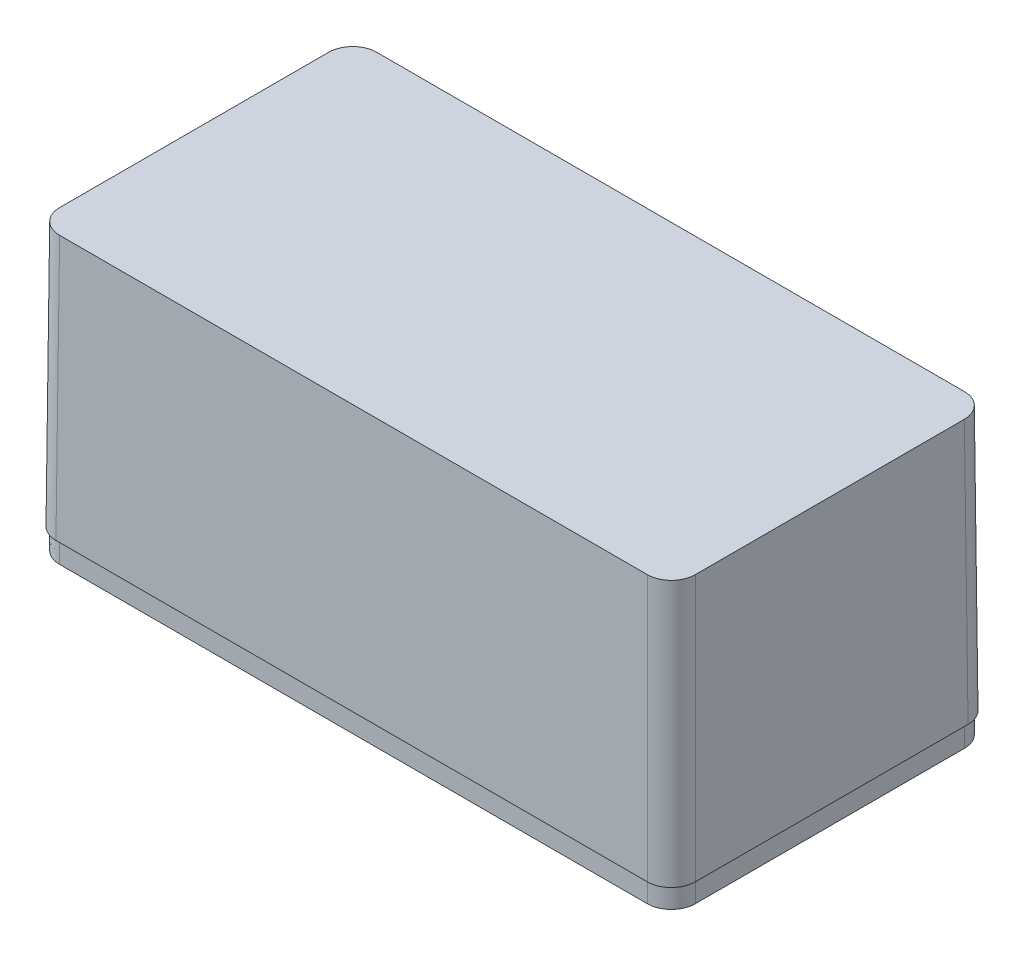
ISO-10303-21;
HEADER;
FILE_DESCRIPTION(('STEP AP214'),'2;1');
FILE_NAME('part.step','',(''),(''),'','','');
FILE_SCHEMA(('AUTOMOTIVE_DESIGN { 1 0 10303 214 1 1 1 1 }'));
ENDSEC;
DATA;
#1=APPLICATION_CONTEXT('core data for automotive mechanical design processes');
#2=APPLICATION_PROTOCOL_DEFINITION('international standard','automotive_design',2000,#1);
#3=PRODUCT_CONTEXT('',#1,'mechanical');
#4=PRODUCT('Part','Part','',(#3));
#5=PRODUCT_RELATED_PRODUCT_CATEGORY('part','',(#4));
#6=PRODUCT_DEFINITION_FORMATION('','',#4);
#7=PRODUCT_DEFINITION_CONTEXT('part definition',#1,'design');
#8=PRODUCT_DEFINITION('design','',#6,#7);
#9=PRODUCT_DEFINITION_SHAPE('','',#8);
#10=(LENGTH_UNIT() NAMED_UNIT(*) SI_UNIT(.MILLI.,.METRE.));
#11=(NAMED_UNIT(*) PLANE_ANGLE_UNIT() SI_UNIT($,.RADIAN.));
#12=(NAMED_UNIT(*) SI_UNIT($,.STERADIAN.) SOLID_ANGLE_UNIT());
#13=UNCERTAINTY_MEASURE_WITH_UNIT(LENGTH_MEASURE(1.E-05),#10,'distance_accuracy_value','');
#14=(GEOMETRIC_REPRESENTATION_CONTEXT(3) GLOBAL_UNCERTAINTY_ASSIGNED_CONTEXT((#13)) GLOBAL_UNIT_ASSIGNED_CONTEXT((#10,
#11,#12)) REPRESENTATION_CONTEXT('',''));
#15=CARTESIAN_POINT('',(0.,0.,0.));
#16=DIRECTION('',(0.,0.,1.));
#17=DIRECTION('',(1.,0.,0.));
#18=AXIS2_PLACEMENT_3D('',#15,#16,#17);
#19=CARTESIAN_POINT('',(0.,-10.2,0.));
#20=DIRECTION('',(0.,-1.,0.));
#21=DIRECTION('',(0.,0.,-1.));
#22=AXIS2_PLACEMENT_3D('',#19,#20,#21);
#23=PLANE('',#22);
#24=CARTESIAN_POINT('',(-19.4106716571701,-10.2,9.46067287566872));
#25=CARTESIAN_POINT('',(-18.9713469698294,-10.2,9.89999756300882));
#26=CARTESIAN_POINT('',(-18.3500328984596,-10.2,9.89999756301078));
#27=(BOUNDED_CURVE() B_SPLINE_CURVE(2,(#24,#25,#26),.UNSPECIFIED.,.F.,
.F.) B_SPLINE_CURVE_WITH_KNOTS((3,3),(3.14159265358979,3.92696771372544),
.UNSPECIFIED.) CURVE() GEOMETRIC_REPRESENTATION_ITEM() RATIONAL_B_SPLINE_CURVE((0.999999999999869,
0.853557698464764,0.853553390720027)) REPRESENTATION_ITEM(''));
#28=CARTESIAN_POINT('',(-18.3500328984598,-10.2,9.89999756301086));
#29=VERTEX_POINT('',#28);
#30=CARTESIAN_POINT('',(-19.4106716571704,-10.2,9.46067287566838));
#31=VERTEX_POINT('',#30);
#32=EDGE_CURVE('E19',#29,#31,#27,.F.);
#33=ORIENTED_EDGE('',*,*,#32,.T.);
#34=CARTESIAN_POINT('',(-19.8499963445129,-10.2,8.40003411695301));
#35=CARTESIAN_POINT('',(-19.8499963445129,-10.2,9.02134818832588));
#36=CARTESIAN_POINT('',(-19.4106716571704,-10.2,9.46067287566838));
#37=(BOUNDED_CURVE() B_SPLINE_CURVE(2,(#34,#35,#36),.UNSPECIFIED.,.F.,
.F.) B_SPLINE_CURVE_WITH_KNOTS((3,3),(2.35621759345099,3.14159265358979),
.UNSPECIFIED.) CURVE() GEOMETRIC_REPRESENTATION_ITEM() RATIONAL_B_SPLINE_CURVE((0.853553390719994,
0.853557698464176,0.999999999999998)) REPRESENTATION_ITEM(''));
#38=CARTESIAN_POINT('',(-19.8499963445147,-10.2,8.400034116953));
#39=VERTEX_POINT('',#38);
#40=EDGE_CURVE('E148',#31,#39,#37,.F.);
#41=ORIENTED_EDGE('',*,*,#40,.T.);
#42=DIRECTION('',(0.,0.,1.));
#43=VECTOR('',#42,1.);
#44=CARTESIAN_POINT('',(-19.84999634452,-10.2,-8.400034116953));
#45=LINE('',#44,#43);
#46=CARTESIAN_POINT('',(-19.8499963445164,-10.2,-8.400034116953));
#47=VERTEX_POINT('',#46);
#48=EDGE_CURVE('E165',#47,#39,#45,.T.);
#49=ORIENTED_EDGE('',*,*,#48,.F.);
#50=CARTESIAN_POINT('',(-19.4106716571704,-10.2,-9.46067287566838));
#51=CARTESIAN_POINT('',(-19.8499963445129,-10.2,-9.02134818832588));
#52=CARTESIAN_POINT('',(-19.8499963445129,-10.2,-8.400034116953));
#53=(BOUNDED_CURVE() B_SPLINE_CURVE(2,(#50,#51,#52),.UNSPECIFIED.,.F.,
.F.) B_SPLINE_CURVE_WITH_KNOTS((3,3),(3.14159265358979,3.92696771372859),
.UNSPECIFIED.) CURVE() GEOMETRIC_REPRESENTATION_ITEM() RATIONAL_B_SPLINE_CURVE((0.999999999999998,
0.853557698464176,0.853553390719995)) REPRESENTATION_ITEM(''));
#54=CARTESIAN_POINT('',(-19.4106716571704,-10.2,-9.46067287566838));
#55=VERTEX_POINT('',#54);
#56=EDGE_CURVE('E176',#55,#47,#53,.T.);
#57=ORIENTED_EDGE('',*,*,#56,.F.);
#58=CARTESIAN_POINT('',(-18.35003289846,-10.2,-9.8999975630109));
#59=CARTESIAN_POINT('',(-18.9713469698294,-10.2,-9.89999756300882));
#60=CARTESIAN_POINT('',(-19.41067165717,-10.2,-9.46067287566873));
#61=(BOUNDED_CURVE() B_SPLINE_CURVE(2,(#58,#59,#60),.UNSPECIFIED.,.F.,
.F.) B_SPLINE_CURVE_WITH_KNOTS((3,3),(2.35621759345414,3.14159265358979),
.UNSPECIFIED.) CURVE() GEOMETRIC_REPRESENTATION_ITEM() RATIONAL_B_SPLINE_CURVE((0.853553390719994,
0.853557698464764,0.999999999999869)) REPRESENTATION_ITEM(''));
#62=CARTESIAN_POINT('',(-18.35003289846,-10.2,-9.89999756301095));
#63=VERTEX_POINT('',#62);
#64=EDGE_CURVE('E359',#63,#55,#61,.T.);
#65=ORIENTED_EDGE('',*,*,#64,.F.);
#66=DIRECTION('',(-1.,0.,0.));
#67=VECTOR('',#66,1.);
#68=CARTESIAN_POINT('',(18.35003289846,-10.2,-9.899997563011));
#69=LINE('',#68,#67);
#70=CARTESIAN_POINT('',(18.35003289846,-10.2,-9.89999756301095));
#71=VERTEX_POINT('',#70);
#72=EDGE_CURVE('E404',#71,#63,#69,.T.);
#73=ORIENTED_EDGE('',*,*,#72,.F.);
#74=CARTESIAN_POINT('',(19.4106716571704,-10.2,-9.46067287566838));
#75=CARTESIAN_POINT('',(18.97134696983,-10.2,-9.89999756300881));
#76=CARTESIAN_POINT('',(18.35003289846,-10.2,-9.8999975630109));
#77=(BOUNDED_CURVE() B_SPLINE_CURVE(2,(#74,#75,#76),.UNSPECIFIED.,.F.,
.F.) B_SPLINE_CURVE_WITH_KNOTS((3,3),(3.14159265358979,3.92696771372543),
.UNSPECIFIED.) CURVE() GEOMETRIC_REPRESENTATION_ITEM() RATIONAL_B_SPLINE_CURVE((1.,
0.853557698464766,0.853553390719993)) REPRESENTATION_ITEM(''));
#78=CARTESIAN_POINT('',(19.4106716571704,-10.2,-9.46067287566838));
#79=VERTEX_POINT('',#78);
#80=EDGE_CURVE('E367',#79,#71,#77,.T.);
#81=ORIENTED_EDGE('',*,*,#80,.F.);
#82=CARTESIAN_POINT('',(19.8499963445129,-10.2,-8.400034116953));
#83=CARTESIAN_POINT('',(19.8499963445129,-10.2,-9.02134818832533));
#84=CARTESIAN_POINT('',(19.4106716571707,-10.2,-9.46067287566805));
#85=(BOUNDED_CURVE() B_SPLINE_CURVE(2,(#82,#83,#84),.UNSPECIFIED.,.F.,
.F.) B_SPLINE_CURVE_WITH_KNOTS((3,3),(2.35621759345098,3.14159265358979),
.UNSPECIFIED.) CURVE() GEOMETRIC_REPRESENTATION_ITEM() RATIONAL_B_SPLINE_CURVE((0.853553390719994,
0.853557698464175,0.999999999999868)) REPRESENTATION_ITEM(''));
#86=CARTESIAN_POINT('',(19.8499963445165,-10.2,-8.400034116953));
#87=VERTEX_POINT('',#86);
#88=EDGE_CURVE('E216',#87,#79,#85,.T.);
#89=ORIENTED_EDGE('',*,*,#88,.F.);
#90=DIRECTION('',(0.,0.,-1.));
#91=VECTOR('',#90,1.);
#92=CARTESIAN_POINT('',(19.84999634452,-10.2,8.400034116953));
#93=LINE('',#92,#91);
#94=CARTESIAN_POINT('',(19.8499963445164,-10.2,8.400034116953));
#95=VERTEX_POINT('',#94);
#96=EDGE_CURVE('E217',#95,#87,#93,.T.);
#97=ORIENTED_EDGE('',*,*,#96,.F.);
#98=CARTESIAN_POINT('',(19.4106716571704,-10.2,9.46067287566838));
#99=CARTESIAN_POINT('',(19.8499963445129,-10.2,9.02134818832588));
#100=CARTESIAN_POINT('',(19.8499963445129,-10.2,8.400034116953));
#101=(BOUNDED_CURVE() B_SPLINE_CURVE(2,(#98,#99,#100),.UNSPECIFIED.,.F.,
.F.) B_SPLINE_CURVE_WITH_KNOTS((3,3),(3.14159265358979,3.92696771372859),
.UNSPECIFIED.) CURVE() GEOMETRIC_REPRESENTATION_ITEM() RATIONAL_B_SPLINE_CURVE((0.999999999999998,
0.853557698464176,0.853553390719995)) REPRESENTATION_ITEM(''));
#102=CARTESIAN_POINT('',(19.4106716571704,-10.2,9.46067287566838));
#103=VERTEX_POINT('',#102);
#104=EDGE_CURVE('E221',#103,#95,#101,.T.);
#105=ORIENTED_EDGE('',*,*,#104,.F.);
#106=CARTESIAN_POINT('',(18.35003289846,-10.2,9.8999975630109));
#107=CARTESIAN_POINT('',(18.9713469698294,-10.2,9.89999756300882));
#108=CARTESIAN_POINT('',(19.41067165717,-10.2,9.46067287566873));
#109=(BOUNDED_CURVE() B_SPLINE_CURVE(2,(#106,#107,#108),.UNSPECIFIED.,.F.,
.F.) B_SPLINE_CURVE_WITH_KNOTS((3,3),(2.35621759345414,3.14159265358979),
.UNSPECIFIED.) CURVE() GEOMETRIC_REPRESENTATION_ITEM() RATIONAL_B_SPLINE_CURVE((0.853553390719994,
0.853557698464764,0.999999999999869)) REPRESENTATION_ITEM(''));
#110=CARTESIAN_POINT('',(18.35003289846,-10.2,9.89999756301095));
#111=VERTEX_POINT('',#110);
#112=EDGE_CURVE('E153',#111,#103,#109,.T.);
#113=ORIENTED_EDGE('',*,*,#112,.F.);
#114=DIRECTION('',(1.,0.,0.));
#115=VECTOR('',#114,1.);
#116=CARTESIAN_POINT('',(-18.35003289846,-10.2,9.899997563011));
#117=LINE('',#116,#115);
#118=EDGE_CURVE('E151',#29,#111,#117,.T.);
#119=ORIENTED_EDGE('',*,*,#118,.F.);
#120=EDGE_LOOP('',(#33,#41,#49,#57,#65,#73,#81,#89,#97,#105,#113,#119));
#121=FACE_BOUND('',#120,.T.);
#122=ADVANCED_FACE('F16',(#121),#23,.T.);
#123=CARTESIAN_POINT('',(-18.35003289846,7.6,9.899997563011));
#124=DIRECTION('',(0.,0.,1.));
#125=DIRECTION('',(1.,0.,0.));
#126=AXIS2_PLACEMENT_3D('',#123,#124,#125);
#127=PLANE('',#126);
#128=DIRECTION('',(0.,1.,0.));
#129=VECTOR('',#128,1.);
#130=CARTESIAN_POINT('',(18.35003289846,7.6,9.8999975630109));
#131=LINE('',#130,#129);
#132=CARTESIAN_POINT('',(18.35003289846,-8.9,9.89999756301092));
#133=VERTEX_POINT('',#132);
#134=EDGE_CURVE('E156',#133,#111,#131,.F.);
#135=ORIENTED_EDGE('',*,*,#134,.F.);
#136=DIRECTION('',(1.,0.,0.));
#137=VECTOR('',#136,1.);
#138=CARTESIAN_POINT('',(-26.71628930331,-8.9,9.899997563011));
#139=LINE('',#138,#137);
#140=CARTESIAN_POINT('',(-18.35003289846,-8.9,9.89999756301095));
#141=VERTEX_POINT('',#140);
#142=EDGE_CURVE('E160',#141,#133,#139,.T.);
#143=ORIENTED_EDGE('',*,*,#142,.F.);
#144=DIRECTION('',(0.,1.,0.));
#145=VECTOR('',#144,1.);
#146=CARTESIAN_POINT('',(-18.35003289846,7.6,9.8999975630109));
#147=LINE('',#146,#145);
#148=EDGE_CURVE('E145',#29,#141,#147,.T.);
#149=ORIENTED_EDGE('',*,*,#148,.F.);
#150=ORIENTED_EDGE('',*,*,#118,.T.);
#151=EDGE_LOOP('',(#135,#143,#149,#150));
#152=FACE_BOUND('',#151,.T.);
#153=ADVANCED_FACE('F158',(#152),#127,.T.);
#154=CARTESIAN_POINT('',(17.2892479221896,7.6,7.33924914068761));
#155=CARTESIAN_POINT('',(16.2285877504098,7.6,8.39990931246743));
#156=CARTESIAN_POINT('',(17.2892996179002,7.6,9.46062117995782));
#157=CARTESIAN_POINT('',(18.3500114853906,7.6,10.5213330474482));
#158=CARTESIAN_POINT('',(19.4106716571704,7.6,9.46067287566839));
#159=CARTESIAN_POINT('',(20.4713318289502,7.6,8.40001270388857));
#160=CARTESIAN_POINT('',(19.4106199614598,7.6,7.33930083639818));
#161=CARTESIAN_POINT('',(18.3499080939694,7.6,6.27858896890779));
#162=CARTESIAN_POINT('',(17.2892479221896,7.6,7.33924914068761));
#163=(BOUNDED_CURVE() B_SPLINE_CURVE(2,(#154,#155,#156,#157,#158,#159,#160,#161,#162),
.UNSPECIFIED.,.T.,.F.) B_SPLINE_CURVE_WITH_KNOTS((3,2,2,2,3),(0.,1.5707963267949,
3.14159265358979,4.71238898038469,6.28318530717959),
.UNSPECIFIED.) CURVE() GEOMETRIC_REPRESENTATION_ITEM() RATIONAL_B_SPLINE_CURVE((1.,
0.707106781186548,1.,0.707106781186548,1.,0.707106781186548,1.,0.707106781186548,1.)) REPRESENTATION_ITEM(''));
#164=DIRECTION('',(0.,1.,0.));
#165=VECTOR('',#164,1.);
#166=SURFACE_OF_LINEAR_EXTRUSION('',#163,#165);
#167=DIRECTION('',(0.,1.,0.));
#168=VECTOR('',#167,1.);
#169=CARTESIAN_POINT('',(19.84999634452,7.6,8.400034116953));
#170=LINE('',#169,#168);
#171=CARTESIAN_POINT('',(19.84999634452,-8.9,8.400034116953));
#172=VERTEX_POINT('',#171);
#173=EDGE_CURVE('E218',#172,#95,#170,.F.);
#174=ORIENTED_EDGE('',*,*,#173,.F.);
#175=CARTESIAN_POINT('',(18.35003289846,-8.9,9.8999975630109));
#176=CARTESIAN_POINT('',(18.97134696983,-8.9,9.89999756300882));
#177=CARTESIAN_POINT('',(19.4106716571704,-8.9,9.46067287566839));
#178=CARTESIAN_POINT('',(19.8499963445128,-8.9,9.02134818832602));
#179=CARTESIAN_POINT('',(19.8499963445129,-8.9,8.40003411695333));
#180=(BOUNDED_CURVE() B_SPLINE_CURVE(2,(#175,#176,#177,#178,#179),.UNSPECIFIED.,.F.,
.F.) B_SPLINE_CURVE_WITH_KNOTS((3,2,3),(2.35621759345414,3.14159265358979,3.9269677137284),
.UNSPECIFIED.) CURVE() GEOMETRIC_REPRESENTATION_ITEM() RATIONAL_B_SPLINE_CURVE((0.853553390719994,
0.853557698464764,1.,0.853557698464213,0.853553390719994)) REPRESENTATION_ITEM(''));
#181=EDGE_CURVE('E163',#133,#172,#180,.T.);
#182=ORIENTED_EDGE('',*,*,#181,.F.);
#183=ORIENTED_EDGE('',*,*,#134,.T.);
#184=ORIENTED_EDGE('',*,*,#112,.T.);
#185=ORIENTED_EDGE('',*,*,#104,.T.);
#186=EDGE_LOOP('',(#174,#182,#183,#184,#185));
#187=FACE_BOUND('',#186,.T.);
#188=ADVANCED_FACE('F229',(#187),#166,.T.);
#189=CARTESIAN_POINT('',(19.84999634452,7.6,8.400034116953));
#190=DIRECTION('',(1.,0.,0.));
#191=DIRECTION('',(0.,0.,-1.));
#192=AXIS2_PLACEMENT_3D('',#189,#190,#191);
#193=PLANE('',#192);
#194=DIRECTION('',(0.,1.,0.));
#195=VECTOR('',#194,1.);
#196=CARTESIAN_POINT('',(19.8499963445129,7.6,-8.400034116953));
#197=LINE('',#196,#195);
#198=CARTESIAN_POINT('',(19.8499963445147,-8.9,-8.400034116953));
#199=VERTEX_POINT('',#198);
#200=EDGE_CURVE('E210',#199,#87,#197,.F.);
#201=ORIENTED_EDGE('',*,*,#200,.F.);
#202=DIRECTION('',(0.,0.,-1.));
#203=VECTOR('',#202,1.);
#204=CARTESIAN_POINT('',(19.84999634452,-8.9,-16.5));
#205=LINE('',#204,#203);
#206=EDGE_CURVE('E307',#172,#199,#205,.T.);
#207=ORIENTED_EDGE('',*,*,#206,.F.);
#208=ORIENTED_EDGE('',*,*,#173,.T.);
#209=ORIENTED_EDGE('',*,*,#96,.T.);
#210=EDGE_LOOP('',(#201,#207,#208,#209));
#211=FACE_BOUND('',#210,.T.);
#212=ADVANCED_FACE('F202',(#211),#193,.T.);
#213=CARTESIAN_POINT('',(17.2892479221896,7.6,-7.33924914068761));
#214=CARTESIAN_POINT('',(18.3499080939694,7.6,-6.27858896890779));
#215=CARTESIAN_POINT('',(19.4106199614598,7.6,-7.33930083639818));
#216=CARTESIAN_POINT('',(20.4713318289502,7.6,-8.40001270388857));
#217=CARTESIAN_POINT('',(19.4106716571704,7.6,-9.46067287566839));
#218=CARTESIAN_POINT('',(18.3500114853906,7.6,-10.5213330474482));
#219=CARTESIAN_POINT('',(17.2892996179002,7.6,-9.46062117995782));
#220=CARTESIAN_POINT('',(16.2285877504098,7.6,-8.39990931246743));
#221=CARTESIAN_POINT('',(17.2892479221896,7.6,-7.33924914068761));
#222=(BOUNDED_CURVE() B_SPLINE_CURVE(2,(#213,#214,#215,#216,#217,#218,#219,#220,#221),
.UNSPECIFIED.,.T.,.F.) B_SPLINE_CURVE_WITH_KNOTS((3,2,2,2,3),(0.,1.5707963267949,
3.14159265358979,4.71238898038469,6.28318530717959),
.UNSPECIFIED.) CURVE() GEOMETRIC_REPRESENTATION_ITEM() RATIONAL_B_SPLINE_CURVE((1.,
0.707106781186548,1.,0.707106781186548,1.,0.707106781186548,1.,0.707106781186548,1.)) REPRESENTATION_ITEM(''));
#223=DIRECTION('',(0.,1.,0.));
#224=VECTOR('',#223,1.);
#225=SURFACE_OF_LINEAR_EXTRUSION('',#222,#224);
#226=DIRECTION('',(0.,1.,0.));
#227=VECTOR('',#226,1.);
#228=CARTESIAN_POINT('',(18.35003289846,7.6,-9.899997563011));
#229=LINE('',#228,#227);
#230=CARTESIAN_POINT('',(18.35003289846,-8.9,-9.899997563011));
#231=VERTEX_POINT('',#230);
#232=EDGE_CURVE('E209',#231,#71,#229,.F.);
#233=ORIENTED_EDGE('',*,*,#232,.F.);
#234=CARTESIAN_POINT('',(19.8499963445129,-8.9,-8.400034116953));
#235=CARTESIAN_POINT('',(19.8499963445129,-8.9,-9.02134818832589));
#236=CARTESIAN_POINT('',(19.4106716571704,-8.9,-9.46067287566839));
#237=CARTESIAN_POINT('',(18.9713469698301,-8.9,-9.89999756300868));
#238=CARTESIAN_POINT('',(18.3500328984603,-8.9,-9.8999975630109));
#239=(BOUNDED_CURVE() B_SPLINE_CURVE(2,(#234,#235,#236,#237,#238),.UNSPECIFIED.,.F.,
.F.) B_SPLINE_CURVE_WITH_KNOTS((3,2,3),(2.35621759345098,3.14159265358979,3.92696771372524),
.UNSPECIFIED.) CURVE() GEOMETRIC_REPRESENTATION_ITEM() RATIONAL_B_SPLINE_CURVE((0.853553390719994,
0.853557698464175,1.,0.853557698464802,0.853553390719994)) REPRESENTATION_ITEM(''));
#240=EDGE_CURVE('E306',#199,#231,#239,.T.);
#241=ORIENTED_EDGE('',*,*,#240,.F.);
#242=ORIENTED_EDGE('',*,*,#200,.T.);
#243=ORIENTED_EDGE('',*,*,#88,.T.);
#244=ORIENTED_EDGE('',*,*,#80,.T.);
#245=EDGE_LOOP('',(#233,#241,#242,#243,#244));
#246=FACE_BOUND('',#245,.T.);
#247=ADVANCED_FACE('F197',(#246),#225,.T.);
#248=CARTESIAN_POINT('',(18.35003289846,7.6,-9.899997563011));
#249=DIRECTION('',(0.,0.,-1.));
#250=DIRECTION('',(-1.,0.,0.));
#251=AXIS2_PLACEMENT_3D('',#248,#249,#250);
#252=PLANE('',#251);
#253=DIRECTION('',(0.,1.,0.));
#254=VECTOR('',#253,1.);
#255=CARTESIAN_POINT('',(-18.35003289846,7.6,-9.8999975630109));
#256=LINE('',#255,#254);
#257=CARTESIAN_POINT('',(-18.35003289846,-8.9,-9.89999756301092));
#258=VERTEX_POINT('',#257);
#259=EDGE_CURVE('E181',#258,#63,#256,.F.);
#260=ORIENTED_EDGE('',*,*,#259,.F.);
#261=DIRECTION('',(1.,0.,0.));
#262=VECTOR('',#261,1.);
#263=CARTESIAN_POINT('',(-26.71628930331,-8.9,-9.899997563011));
#264=LINE('',#263,#262);
#265=EDGE_CURVE('E300',#231,#258,#264,.F.);
#266=ORIENTED_EDGE('',*,*,#265,.F.);
#267=ORIENTED_EDGE('',*,*,#232,.T.);
#268=ORIENTED_EDGE('',*,*,#72,.T.);
#269=EDGE_LOOP('',(#260,#266,#267,#268));
#270=FACE_BOUND('',#269,.T.);
#271=ADVANCED_FACE('F192',(#270),#252,.T.);
#272=CARTESIAN_POINT('',(-17.2892479221896,7.6,-7.33924914068761));
#273=CARTESIAN_POINT('',(-16.2285877504098,7.6,-8.39990931246743));
#274=CARTESIAN_POINT('',(-17.2892996179002,7.6,-9.46062117995782));
#275=CARTESIAN_POINT('',(-18.3500114853906,7.6,-10.5213330474482));
#276=CARTESIAN_POINT('',(-19.4106716571704,7.6,-9.46067287566839));
#277=CARTESIAN_POINT('',(-20.4713318289502,7.6,-8.40001270388857));
#278=CARTESIAN_POINT('',(-19.4106199614598,7.6,-7.33930083639818));
#279=CARTESIAN_POINT('',(-18.3499080939694,7.6,-6.27858896890779));
#280=CARTESIAN_POINT('',(-17.2892479221896,7.6,-7.33924914068761));
#281=(BOUNDED_CURVE() B_SPLINE_CURVE(2,(#272,#273,#274,#275,#276,#277,#278,#279,#280),
.UNSPECIFIED.,.T.,.F.) B_SPLINE_CURVE_WITH_KNOTS((3,2,2,2,3),(0.,1.5707963267949,
3.14159265358979,4.71238898038469,6.28318530717959),
.UNSPECIFIED.) CURVE() GEOMETRIC_REPRESENTATION_ITEM() RATIONAL_B_SPLINE_CURVE((1.,
0.707106781186548,1.,0.707106781186548,1.,0.707106781186548,1.,0.707106781186548,1.)) REPRESENTATION_ITEM(''));
#282=DIRECTION('',(0.,1.,0.));
#283=VECTOR('',#282,1.);
#284=SURFACE_OF_LINEAR_EXTRUSION('',#281,#283);
#285=DIRECTION('',(0.,1.,0.));
#286=VECTOR('',#285,1.);
#287=CARTESIAN_POINT('',(-19.84999634452,7.6,-8.400034116953));
#288=LINE('',#287,#286);
#289=CARTESIAN_POINT('',(-19.84999634452,-8.9,-8.400034116953));
#290=VERTEX_POINT('',#289);
#291=EDGE_CURVE('E173',#290,#47,#288,.F.);
#292=ORIENTED_EDGE('',*,*,#291,.F.);
#293=CARTESIAN_POINT('',(-18.35003289846,-8.9,-9.8999975630109));
#294=CARTESIAN_POINT('',(-18.97134696983,-8.9,-9.89999756300882));
#295=CARTESIAN_POINT('',(-19.4106716571704,-8.9,-9.46067287566839));
#296=CARTESIAN_POINT('',(-19.8499963445128,-8.9,-9.02134818832602));
#297=CARTESIAN_POINT('',(-19.8499963445129,-8.9,-8.40003411695333));
#298=(BOUNDED_CURVE() B_SPLINE_CURVE(2,(#293,#294,#295,#296,#297),.UNSPECIFIED.,.F.,
.F.) B_SPLINE_CURVE_WITH_KNOTS((3,2,3),(2.35621759345414,3.14159265358979,3.92696771372839),
.UNSPECIFIED.) CURVE() GEOMETRIC_REPRESENTATION_ITEM() RATIONAL_B_SPLINE_CURVE((0.853553390719994,
0.853557698464764,1.,0.853557698464214,0.853553390719994)) REPRESENTATION_ITEM(''));
#299=EDGE_CURVE('E298',#258,#290,#298,.T.);
#300=ORIENTED_EDGE('',*,*,#299,.F.);
#301=ORIENTED_EDGE('',*,*,#259,.T.);
#302=ORIENTED_EDGE('',*,*,#64,.T.);
#303=ORIENTED_EDGE('',*,*,#56,.T.);
#304=EDGE_LOOP('',(#292,#300,#301,#302,#303));
#305=FACE_BOUND('',#304,.T.);
#306=ADVANCED_FACE('F187',(#305),#284,.T.);
#307=CARTESIAN_POINT('',(-19.84999634452,7.6,-8.400034116953));
#308=DIRECTION('',(-1.,0.,0.));
#309=DIRECTION('',(0.,0.,1.));
#310=AXIS2_PLACEMENT_3D('',#307,#308,#309);
#311=PLANE('',#310);
#312=DIRECTION('',(0.,1.,0.));
#313=VECTOR('',#312,1.);
#314=CARTESIAN_POINT('',(-19.8499963445129,7.6,8.400034116953));
#315=LINE('',#314,#313);
#316=CARTESIAN_POINT('',(-19.8499963445147,-8.9,8.400034116953));
#317=VERTEX_POINT('',#316);
#318=EDGE_CURVE('E161',#317,#39,#315,.F.);
#319=ORIENTED_EDGE('',*,*,#318,.F.);
#320=DIRECTION('',(0.,0.,-1.));
#321=VECTOR('',#320,1.);
#322=CARTESIAN_POINT('',(-19.84999634452,-8.9,-16.5));
#323=LINE('',#322,#321);
#324=EDGE_CURVE('E289',#290,#317,#323,.F.);
#325=ORIENTED_EDGE('',*,*,#324,.F.);
#326=ORIENTED_EDGE('',*,*,#291,.T.);
#327=ORIENTED_EDGE('',*,*,#48,.T.);
#328=EDGE_LOOP('',(#319,#325,#326,#327));
#329=FACE_BOUND('',#328,.T.);
#330=ADVANCED_FACE('F191',(#329),#311,.T.);
#331=CARTESIAN_POINT('',(-17.2892479221896,7.6,7.33924914068761));
#332=CARTESIAN_POINT('',(-18.3499080939694,7.6,6.27858896890779));
#333=CARTESIAN_POINT('',(-19.4106199614598,7.6,7.33930083639818));
#334=CARTESIAN_POINT('',(-20.4713318289502,7.6,8.40001270388857));
#335=CARTESIAN_POINT('',(-19.4106716571704,7.6,9.46067287566839));
#336=CARTESIAN_POINT('',(-18.3500114853906,7.6,10.5213330474482));
#337=CARTESIAN_POINT('',(-17.2892996179002,7.6,9.46062117995782));
#338=CARTESIAN_POINT('',(-16.2285877504098,7.6,8.39990931246743));
#339=CARTESIAN_POINT('',(-17.2892479221896,7.6,7.33924914068761));
#340=(BOUNDED_CURVE() B_SPLINE_CURVE(2,(#331,#332,#333,#334,#335,#336,#337,#338,#339),
.UNSPECIFIED.,.T.,.F.) B_SPLINE_CURVE_WITH_KNOTS((3,2,2,2,3),(0.,1.5707963267949,
3.14159265358979,4.71238898038469,6.28318530717959),
.UNSPECIFIED.) CURVE() GEOMETRIC_REPRESENTATION_ITEM() RATIONAL_B_SPLINE_CURVE((1.,
0.707106781186548,1.,0.707106781186548,1.,0.707106781186548,1.,0.707106781186548,1.)) REPRESENTATION_ITEM(''));
#341=DIRECTION('',(0.,1.,0.));
#342=VECTOR('',#341,1.);
#343=SURFACE_OF_LINEAR_EXTRUSION('',#340,#342);
#344=ORIENTED_EDGE('',*,*,#148,.T.);
#345=CARTESIAN_POINT('',(-19.8499963445129,-8.9,8.400034116953));
#346=CARTESIAN_POINT('',(-19.8499963445129,-8.9,9.02134818832589));
#347=CARTESIAN_POINT('',(-19.4106716571704,-8.9,9.46067287566839));
#348=CARTESIAN_POINT('',(-18.9713469698301,-8.9,9.89999756300868));
#349=CARTESIAN_POINT('',(-18.3500328984603,-8.9,9.8999975630109));
#350=(BOUNDED_CURVE() B_SPLINE_CURVE(2,(#345,#346,#347,#348,#349),.UNSPECIFIED.,.F.,
.F.) B_SPLINE_CURVE_WITH_KNOTS((3,2,3),(2.35621759345098,3.14159265358979,3.92696771372524),
.UNSPECIFIED.) CURVE() GEOMETRIC_REPRESENTATION_ITEM() RATIONAL_B_SPLINE_CURVE((0.853553390719994,
0.853557698464175,1.,0.853557698464802,0.853553390719994)) REPRESENTATION_ITEM(''));
#351=EDGE_CURVE('E292',#317,#141,#350,.T.);
#352=ORIENTED_EDGE('',*,*,#351,.F.);
#353=ORIENTED_EDGE('',*,*,#318,.T.);
#354=ORIENTED_EDGE('',*,*,#40,.F.);
#355=ORIENTED_EDGE('',*,*,#32,.F.);
#356=EDGE_LOOP('',(#344,#352,#353,#354,#355));
#357=FACE_BOUND('',#356,.T.);
#358=ADVANCED_FACE('F142',(#357),#343,.T.);
#359=CARTESIAN_POINT('',(-26.71628930331,-8.9,-16.5));
#360=DIRECTION('',(0.,-1.,0.));
#361=DIRECTION('',(0.,0.,-1.));
#362=AXIS2_PLACEMENT_3D('',#359,#360,#361);
#363=PLANE('',#362);
#364=ORIENTED_EDGE('',*,*,#324,.T.);
#365=ORIENTED_EDGE('',*,*,#351,.T.);
#366=ORIENTED_EDGE('',*,*,#142,.T.);
#367=ORIENTED_EDGE('',*,*,#181,.T.);
#368=ORIENTED_EDGE('',*,*,#206,.T.);
#369=ORIENTED_EDGE('',*,*,#240,.T.);
#370=ORIENTED_EDGE('',*,*,#265,.T.);
#371=ORIENTED_EDGE('',*,*,#299,.T.);
#372=EDGE_LOOP('',(#364,#365,#366,#367,#368,#369,#370,#371));
#373=FACE_BOUND('',#372,.T.);
#374=DIRECTION('',(1.,0.,0.));
#375=VECTOR('',#374,1.);
#376=CARTESIAN_POINT('',(-21.92869360171,-8.89999999999998,10.0151911651139));
#377=LINE('',#376,#375);
#378=CARTESIAN_POINT('',(-18.4652265005643,-8.89999999999998,10.0151911651143));
#379=VERTEX_POINT('',#378);
#380=CARTESIAN_POINT('',(18.4652265005643,-8.89999999999998,10.0151911651143));
#381=VERTEX_POINT('',#380);
#382=EDGE_CURVE('E293',#379,#381,#377,.T.);
#383=ORIENTED_EDGE('',*,*,#382,.F.);
#384=CARTESIAN_POINT('',(-18.4651533917897,-8.9,8.5151546102817));
#385=DIRECTION('',(0.,-1.,0.));
#386=DIRECTION('',(0.707106781186548,0.,-0.707106781186548));
#387=AXIS2_PLACEMENT_3D('',#384,#385,#386);
#388=ELLIPSE('',#387,1.50007310877465,1.5);
#389=CARTESIAN_POINT('',(-19.9651899466208,-8.9,8.51522771905626));
#390=VERTEX_POINT('',#389);
#391=EDGE_CURVE('E542',#390,#379,#388,.F.);
#392=ORIENTED_EDGE('',*,*,#391,.F.);
#393=DIRECTION('',(0.,0.,1.));
#394=VECTOR('',#393,1.);
#395=CARTESIAN_POINT('',(-19.9651899466157,-8.90000000000003,-11.92869360171));
#396=LINE('',#395,#394);
#397=CARTESIAN_POINT('',(-19.9651899466191,-8.90000000000002,-8.51522771905617));
#398=VERTEX_POINT('',#397);
#399=EDGE_CURVE('E310',#398,#390,#396,.T.);
#400=ORIENTED_EDGE('',*,*,#399,.F.);
#401=CARTESIAN_POINT('',(-18.4651533917897,-8.9,-8.5151546102817));
#402=DIRECTION('',(0.,-1.,0.));
#403=DIRECTION('',(0.707106781186548,0.,0.707106781186548));
#404=AXIS2_PLACEMENT_3D('',#401,#402,#403);
#405=ELLIPSE('',#404,1.50007310877465,1.5);
#406=CARTESIAN_POINT('',(-18.4652265005638,-8.89999999999998,-10.0151911651143));
#407=VERTEX_POINT('',#406);
#408=EDGE_CURVE('E545',#407,#398,#405,.F.);
#409=ORIENTED_EDGE('',*,*,#408,.F.);
#410=DIRECTION('',(1.,0.,0.));
#411=VECTOR('',#410,1.);
#412=CARTESIAN_POINT('',(21.92869360171,-8.89999999999998,-10.0151911651139));
#413=LINE('',#412,#411);
#414=CARTESIAN_POINT('',(18.4652265005622,-8.89999999999999,-10.0151911651142));
#415=VERTEX_POINT('',#414);
#416=EDGE_CURVE('E313',#415,#407,#413,.F.);
#417=ORIENTED_EDGE('',*,*,#416,.F.);
#418=CARTESIAN_POINT('',(18.4651533917897,-8.9,-8.5151546102817));
#419=DIRECTION('',(0.,-1.,0.));
#420=DIRECTION('',(-0.707106781186548,0.,0.707106781186548));
#421=AXIS2_PLACEMENT_3D('',#418,#419,#420);
#422=ELLIPSE('',#421,1.50007310877465,1.5);
#423=CARTESIAN_POINT('',(19.9651899466208,-8.9,-8.51522771905626));
#424=VERTEX_POINT('',#423);
#425=EDGE_CURVE('E329',#424,#415,#422,.F.);
#426=ORIENTED_EDGE('',*,*,#425,.F.);
#427=DIRECTION('',(0.,0.,1.));
#428=VECTOR('',#427,1.);
#429=CARTESIAN_POINT('',(19.9651899466157,-8.90000000000003,11.92869360171));
#430=LINE('',#429,#428);
#431=CARTESIAN_POINT('',(19.9651899466191,-8.90000000000002,8.51522771905617));
#432=VERTEX_POINT('',#431);
#433=EDGE_CURVE('E316',#432,#424,#430,.F.);
#434=ORIENTED_EDGE('',*,*,#433,.F.);
#435=CARTESIAN_POINT('',(18.4651533917897,-8.9,8.5151546102817));
#436=DIRECTION('',(0.,-1.,0.));
#437=DIRECTION('',(-0.707106781186548,0.,-0.707106781186548));
#438=AXIS2_PLACEMENT_3D('',#435,#436,#437);
#439=ELLIPSE('',#438,1.50007310877465,1.5);
#440=EDGE_CURVE('E318',#381,#432,#439,.F.);
#441=ORIENTED_EDGE('',*,*,#440,.F.);
#442=EDGE_LOOP('',(#383,#392,#400,#409,#417,#426,#434,#441));
#443=FACE_BOUND('',#442,.T.);
#444=ADVANCED_FACE('F275',(#373,#443),#363,.T.);
#445=CARTESIAN_POINT('',(-21.92869360171,7.59930187397,9.900002436929));
#446=DIRECTION('',(0.,0.00698126029796196,0.999975630705395));
#447=DIRECTION('',(0.,-0.999975630705395,0.00698126029796196));
#448=AXIS2_PLACEMENT_3D('',#445,#446,#447);
#449=PLANE('',#448);
#450=DIRECTION('',(1.,0.,0.));
#451=VECTOR('',#450,1.);
#452=CARTESIAN_POINT('',(0.,7.6,9.899997563011));
#453=LINE('',#452,#451);
#454=CARTESIAN_POINT('',(-18.3500328984611,7.6,9.89999756301118));
#455=VERTEX_POINT('',#454);
#456=CARTESIAN_POINT('',(18.3500328984611,7.6,9.89999756301118));
#457=VERTEX_POINT('',#456);
#458=EDGE_CURVE('E541',#455,#457,#453,.T.);
#459=ORIENTED_EDGE('',*,*,#458,.F.);
#460=DIRECTION('',(0.00698109017786393,0.99995126319229,-0.00698109017786393));
#461=VECTOR('',#460,1.);
#462=CARTESIAN_POINT('',(-18.69993388178,-42.5188097199131,10.2498985463301));
#463=LINE('',#462,#461);
#464=EDGE_CURVE('E544',#379,#455,#463,.T.);
#465=ORIENTED_EDGE('',*,*,#464,.F.);
#466=ORIENTED_EDGE('',*,*,#382,.T.);
#467=DIRECTION('',(-0.00698109017786393,0.99995126319229,-0.00698109017786393));
#468=VECTOR('',#467,1.);
#469=CARTESIAN_POINT('',(18.69993388178,-42.5188097199131,10.2498985463301));
#470=LINE('',#469,#468);
#471=EDGE_CURVE('E324',#457,#381,#470,.F.);
#472=ORIENTED_EDGE('',*,*,#471,.F.);
#473=EDGE_LOOP('',(#459,#465,#466,#472));
#474=FACE_BOUND('',#473,.T.);
#475=ADVANCED_FACE('F271',(#474),#449,.T.);
#476=CARTESIAN_POINT('',(18.69993388178,-42.52928161036,8.749935100272));
#477=DIRECTION('',(-0.00698109017786393,0.99995126319229,-0.00698109017786393));
#478=DIRECTION('',(0.,0.00698126029796144,0.999975630705395));
#479=AXIS2_PLACEMENT_3D('',#476,#477,#478);
#480=CYLINDRICAL_SURFACE('',#479,1.5);
#481=DIRECTION('',(0.00698109017786456,-0.999951263192291,0.00698109017785247));
#482=VECTOR('',#481,1.);
#483=CARTESIAN_POINT('',(19.8499963445125,7.59999999999995,8.400034116953));
#484=LINE('',#483,#482);
#485=CARTESIAN_POINT('',(19.8499963445159,7.6,8.40003411695307));
#486=VERTEX_POINT('',#485);
#487=EDGE_CURVE('E317',#486,#432,#484,.T.);
#488=ORIENTED_EDGE('',*,*,#487,.F.);
#489=CARTESIAN_POINT('',(18.3499597896865,7.6,8.39996100817851));
#490=DIRECTION('',(0.,1.,0.));
#491=DIRECTION('',(-0.707106781186548,0.,-0.707106781186548));
#492=AXIS2_PLACEMENT_3D('',#489,#490,#491);
#493=ELLIPSE('',#492,1.50007310877465,1.5);
#494=EDGE_CURVE('E538',#457,#486,#493,.T.);
#495=ORIENTED_EDGE('',*,*,#494,.F.);
#496=ORIENTED_EDGE('',*,*,#471,.T.);
#497=ORIENTED_EDGE('',*,*,#440,.T.);
#498=EDGE_LOOP('',(#488,#495,#496,#497));
#499=FACE_BOUND('',#498,.T.);
#500=ADVANCED_FACE('F267',(#499),#480,.T.);
#501=CARTESIAN_POINT('',(19.85000365539,7.598952810955,11.92869360171));
#502=DIRECTION('',(0.999975630705395,0.00698126029796196,0.));
#503=DIRECTION('',(-0.00698126029796196,0.999975630705395,0.));
#504=AXIS2_PLACEMENT_3D('',#501,#502,#503);
#505=PLANE('',#504);
#506=DIRECTION('',(0.,0.,1.));
#507=VECTOR('',#506,1.);
#508=CARTESIAN_POINT('',(19.84999634452,7.6,0.));
#509=LINE('',#508,#507);
#510=CARTESIAN_POINT('',(19.8499963445194,7.6,-8.40003411695307));
#511=VERTEX_POINT('',#510);
#512=EDGE_CURVE('E537',#486,#511,#509,.F.);
#513=ORIENTED_EDGE('',*,*,#512,.F.);
#514=ORIENTED_EDGE('',*,*,#487,.T.);
#515=ORIENTED_EDGE('',*,*,#433,.T.);
#516=DIRECTION('',(-0.00698109017786393,0.99995126319229,0.00698109017786393));
#517=VECTOR('',#516,1.);
#518=CARTESIAN_POINT('',(20.1998973278381,-42.5188097199131,-8.74993510027186));
#519=LINE('',#518,#517);
#520=EDGE_CURVE('E321',#511,#424,#519,.F.);
#521=ORIENTED_EDGE('',*,*,#520,.F.);
#522=EDGE_LOOP('',(#513,#514,#515,#521));
#523=FACE_BOUND('',#522,.T.);
#524=ADVANCED_FACE('F263',(#523),#505,.T.);
#525=CARTESIAN_POINT('',(18.69993388178,-42.52928161036,-8.749935100272));
#526=DIRECTION('',(-0.00698109017786393,0.99995126319229,0.00698109017786393));
#527=DIRECTION('',(0.,-0.00698126029796144,0.999975630705395));
#528=AXIS2_PLACEMENT_3D('',#525,#526,#527);
#529=CYLINDRICAL_SURFACE('',#528,1.5);
#530=DIRECTION('',(0.00698109017767071,-0.999951263192292,-0.00698109017786447));
#531=VECTOR('',#530,1.);
#532=CARTESIAN_POINT('',(18.35003289846,7.6,-9.89999756301069));
#533=LINE('',#532,#531);
#534=CARTESIAN_POINT('',(18.3500328984606,7.6,-9.89999756301096));
#535=VERTEX_POINT('',#534);
#536=EDGE_CURVE('E315',#535,#415,#533,.T.);
#537=ORIENTED_EDGE('',*,*,#536,.F.);
#538=CARTESIAN_POINT('',(18.3499597896865,7.6,-8.39996100817851));
#539=DIRECTION('',(0.,1.,0.));
#540=DIRECTION('',(-0.707106781186548,0.,0.707106781186548));
#541=AXIS2_PLACEMENT_3D('',#538,#539,#540);
#542=ELLIPSE('',#541,1.50007310877465,1.5);
#543=EDGE_CURVE('E534',#511,#535,#542,.T.);
#544=ORIENTED_EDGE('',*,*,#543,.F.);
#545=ORIENTED_EDGE('',*,*,#520,.T.);
#546=ORIENTED_EDGE('',*,*,#425,.T.);
#547=EDGE_LOOP('',(#537,#544,#545,#546));
#548=FACE_BOUND('',#547,.T.);
#549=ADVANCED_FACE('F259',(#548),#529,.T.);
#550=CARTESIAN_POINT('',(21.92869360171,7.59930187397,-9.900002436929));
#551=DIRECTION('',(0.,0.00698126029796196,-0.999975630705395));
#552=DIRECTION('',(0.,0.999975630705395,0.00698126029796196));
#553=AXIS2_PLACEMENT_3D('',#550,#551,#552);
#554=PLANE('',#553);
#555=ORIENTED_EDGE('',*,*,#416,.T.);
#556=DIRECTION('',(0.00698109017786393,0.99995126319229,0.00698109017786393));
#557=VECTOR('',#556,1.);
#558=CARTESIAN_POINT('',(-18.6999338817789,-42.5188097199131,-10.2498985463301));
#559=LINE('',#558,#557);
#560=CARTESIAN_POINT('',(-18.3500328984606,7.6,-9.89999756301118));
#561=VERTEX_POINT('',#560);
#562=EDGE_CURVE('E314',#561,#407,#559,.F.);
#563=ORIENTED_EDGE('',*,*,#562,.F.);
#564=DIRECTION('',(1.,0.,0.));
#565=VECTOR('',#564,1.);
#566=CARTESIAN_POINT('',(0.,7.6,-9.899997563011));
#567=LINE('',#566,#565);
#568=EDGE_CURVE('E533',#535,#561,#567,.F.);
#569=ORIENTED_EDGE('',*,*,#568,.F.);
#570=ORIENTED_EDGE('',*,*,#536,.T.);
#571=EDGE_LOOP('',(#555,#563,#569,#570));
#572=FACE_BOUND('',#571,.T.);
#573=ADVANCED_FACE('F255',(#572),#554,.T.);
#574=CARTESIAN_POINT('',(-18.69993388178,-42.52928161036,-8.749935100272));
#575=DIRECTION('',(0.00698109017786393,0.99995126319229,0.00698109017786393));
#576=DIRECTION('',(0.,-0.00698126029796144,0.999975630705395));
#577=AXIS2_PLACEMENT_3D('',#574,#575,#576);
#578=CYLINDRICAL_SURFACE('',#577,1.5);
#579=DIRECTION('',(-0.00698109017786456,-0.999951263192291,-0.00698109017785247));
#580=VECTOR('',#579,1.);
#581=CARTESIAN_POINT('',(-19.8499963445125,7.59999999999995,-8.400034116953));
#582=LINE('',#581,#580);
#583=CARTESIAN_POINT('',(-19.8499963445159,7.6,-8.40003411695307));
#584=VERTEX_POINT('',#583);
#585=EDGE_CURVE('E312',#584,#398,#582,.T.);
#586=ORIENTED_EDGE('',*,*,#585,.F.);
#587=CARTESIAN_POINT('',(-18.3499597896865,7.6,-8.39996100817851));
#588=DIRECTION('',(0.,1.,0.));
#589=DIRECTION('',(0.707106781186548,0.,0.707106781186548));
#590=AXIS2_PLACEMENT_3D('',#587,#588,#589);
#591=ELLIPSE('',#590,1.50007310877465,1.5);
#592=EDGE_CURVE('E530',#561,#584,#591,.T.);
#593=ORIENTED_EDGE('',*,*,#592,.F.);
#594=ORIENTED_EDGE('',*,*,#562,.T.);
#595=ORIENTED_EDGE('',*,*,#408,.T.);
#596=EDGE_LOOP('',(#586,#593,#594,#595));
#597=FACE_BOUND('',#596,.T.);
#598=ADVANCED_FACE('F252',(#597),#578,.T.);
#599=CARTESIAN_POINT('',(-19.85000365539,7.598952810955,-11.92869360171));
#600=DIRECTION('',(-0.999975630705395,0.00698126029796196,0.));
#601=DIRECTION('',(-0.00698126029796196,-0.999975630705395,0.));
#602=AXIS2_PLACEMENT_3D('',#599,#600,#601);
#603=PLANE('',#602);
#604=ORIENTED_EDGE('',*,*,#399,.T.);
#605=DIRECTION('',(0.00698109017786393,0.99995126319229,-0.00698109017786393));
#606=VECTOR('',#605,1.);
#607=CARTESIAN_POINT('',(-20.1998973278381,-42.5188097199131,8.74993510027186));
#608=LINE('',#607,#606);
#609=CARTESIAN_POINT('',(-19.8499963445194,7.6,8.40003411695307));
#610=VERTEX_POINT('',#609);
#611=EDGE_CURVE('E36',#610,#390,#608,.F.);
#612=ORIENTED_EDGE('',*,*,#611,.F.);
#613=DIRECTION('',(0.,0.,1.));
#614=VECTOR('',#613,1.);
#615=CARTESIAN_POINT('',(-19.84999634452,7.6,0.));
#616=LINE('',#615,#614);
#617=EDGE_CURVE('E27',#584,#610,#616,.T.);
#618=ORIENTED_EDGE('',*,*,#617,.F.);
#619=ORIENTED_EDGE('',*,*,#585,.T.);
#620=EDGE_LOOP('',(#604,#612,#618,#619));
#621=FACE_BOUND('',#620,.T.);
#622=ADVANCED_FACE('F245',(#621),#603,.T.);
#623=CARTESIAN_POINT('',(-18.69993388178,-42.52928161036,8.749935100272));
#624=DIRECTION('',(0.00698109017786393,0.99995126319229,-0.00698109017786393));
#625=DIRECTION('',(0.,0.00698126029796144,0.999975630705395));
#626=AXIS2_PLACEMENT_3D('',#623,#624,#625);
#627=CYLINDRICAL_SURFACE('',#626,1.5);
#628=ORIENTED_EDGE('',*,*,#464,.T.);
#629=CARTESIAN_POINT('',(-18.3499597896865,7.6,8.39996100817851));
#630=DIRECTION('',(0.,1.,0.));
#631=DIRECTION('',(0.707106781186548,0.,-0.707106781186548));
#632=AXIS2_PLACEMENT_3D('',#629,#630,#631);
#633=ELLIPSE('',#632,1.50007310877465,1.5);
#634=EDGE_CURVE('E11',#610,#455,#633,.T.);
#635=ORIENTED_EDGE('',*,*,#634,.F.);
#636=ORIENTED_EDGE('',*,*,#611,.T.);
#637=ORIENTED_EDGE('',*,*,#391,.T.);
#638=EDGE_LOOP('',(#628,#635,#636,#637));
#639=FACE_BOUND('',#638,.T.);
#640=ADVANCED_FACE('F239',(#639),#627,.T.);
#641=CARTESIAN_POINT('',(0.,7.6,0.));
#642=DIRECTION('',(0.,1.,0.));
#643=DIRECTION('',(0.,0.,1.));
#644=AXIS2_PLACEMENT_3D('',#641,#642,#643);
#645=PLANE('',#644);
#646=ORIENTED_EDGE('',*,*,#617,.T.);
#647=ORIENTED_EDGE('',*,*,#634,.T.);
#648=ORIENTED_EDGE('',*,*,#458,.T.);
#649=ORIENTED_EDGE('',*,*,#494,.T.);
#650=ORIENTED_EDGE('',*,*,#512,.T.);
#651=ORIENTED_EDGE('',*,*,#543,.T.);
#652=ORIENTED_EDGE('',*,*,#568,.T.);
#653=ORIENTED_EDGE('',*,*,#592,.T.);
#654=EDGE_LOOP('',(#646,#647,#648,#649,#650,#651,#652,#653));
#655=FACE_BOUND('',#654,.T.);
#656=ADVANCED_FACE('F237',(#655),#645,.T.);
#657=CLOSED_SHELL('',(#122,#153,#188,#212,#247,#271,#306,#330,#358,#444,#475,#500,#524,#549,
#573,#598,#622,#640,#656));
#658=MANIFOLD_SOLID_BREP('B1',#657);
#659=ADVANCED_BREP_SHAPE_REPRESENTATION('',(#18,#658),#14);
#660=SHAPE_DEFINITION_REPRESENTATION(#9,#659);
ENDSEC;
END-ISO-10303-21;
